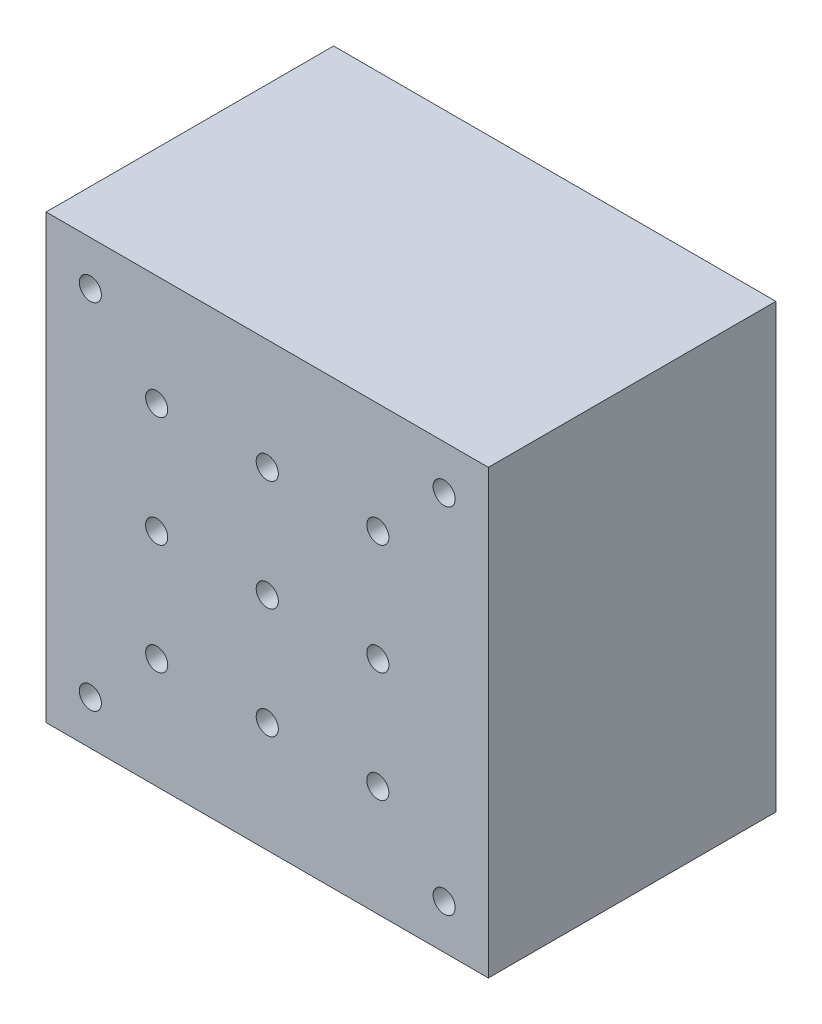
ISO-10303-21;
HEADER;
FILE_DESCRIPTION(('STEP AP214'),'2;1');
FILE_NAME('part.step','',(''),(''),'','','');
FILE_SCHEMA(('AUTOMOTIVE_DESIGN { 1 0 10303 214 1 1 1 1 }'));
ENDSEC;
DATA;
#1=APPLICATION_CONTEXT('core data for automotive mechanical design processes');
#2=APPLICATION_PROTOCOL_DEFINITION('international standard','automotive_design',2000,#1);
#3=PRODUCT_CONTEXT('',#1,'mechanical');
#4=PRODUCT('Part','Part','',(#3));
#5=PRODUCT_RELATED_PRODUCT_CATEGORY('part','',(#4));
#6=PRODUCT_DEFINITION_FORMATION('','',#4);
#7=PRODUCT_DEFINITION_CONTEXT('part definition',#1,'design');
#8=PRODUCT_DEFINITION('design','',#6,#7);
#9=PRODUCT_DEFINITION_SHAPE('','',#8);
#10=(LENGTH_UNIT() NAMED_UNIT(*) SI_UNIT(.MILLI.,.METRE.));
#11=(NAMED_UNIT(*) PLANE_ANGLE_UNIT() SI_UNIT($,.RADIAN.));
#12=(NAMED_UNIT(*) SI_UNIT($,.STERADIAN.) SOLID_ANGLE_UNIT());
#13=UNCERTAINTY_MEASURE_WITH_UNIT(LENGTH_MEASURE(1.E-05),#10,'distance_accuracy_value','');
#14=(GEOMETRIC_REPRESENTATION_CONTEXT(3) GLOBAL_UNCERTAINTY_ASSIGNED_CONTEXT((#13)) GLOBAL_UNIT_ASSIGNED_CONTEXT((#10,
#11,#12)) REPRESENTATION_CONTEXT('',''));
#15=CARTESIAN_POINT('',(0.,0.,0.));
#16=DIRECTION('',(0.,0.,1.));
#17=DIRECTION('',(1.,0.,0.));
#18=AXIS2_PLACEMENT_3D('',#15,#16,#17);
#19=CARTESIAN_POINT('',(63.5,-63.5,82.55));
#20=DIRECTION('',(-1.,0.,0.));
#21=DIRECTION('',(0.,0.,1.));
#22=AXIS2_PLACEMENT_3D('',#19,#20,#21);
#23=PLANE('',#22);
#24=DIRECTION('',(0.,1.,0.));
#25=VECTOR('',#24,1.);
#26=CARTESIAN_POINT('',(63.5,-63.5,0.));
#27=LINE('',#26,#25);
#28=CARTESIAN_POINT('',(63.5,-63.5,0.));
#29=VERTEX_POINT('',#28);
#30=CARTESIAN_POINT('',(63.5,63.5,0.));
#31=VERTEX_POINT('',#30);
#32=EDGE_CURVE('E96',#29,#31,#27,.T.);
#33=ORIENTED_EDGE('',*,*,#32,.T.);
#34=DIRECTION('',(0.,0.,-1.));
#35=VECTOR('',#34,1.);
#36=CARTESIAN_POINT('',(63.5,63.5,82.55));
#37=LINE('',#36,#35);
#38=CARTESIAN_POINT('',(63.5,63.5,82.55));
#39=VERTEX_POINT('',#38);
#40=EDGE_CURVE('E11',#39,#31,#37,.T.);
#41=ORIENTED_EDGE('',*,*,#40,.F.);
#42=DIRECTION('',(0.,1.,0.));
#43=VECTOR('',#42,1.);
#44=CARTESIAN_POINT('',(63.5,-63.5,82.55));
#45=LINE('',#44,#43);
#46=CARTESIAN_POINT('',(63.5,-63.5,82.55));
#47=VERTEX_POINT('',#46);
#48=EDGE_CURVE('E84',#47,#39,#45,.T.);
#49=ORIENTED_EDGE('',*,*,#48,.F.);
#50=DIRECTION('',(0.,0.,-1.));
#51=VECTOR('',#50,1.);
#52=CARTESIAN_POINT('',(63.5,-63.5,82.55));
#53=LINE('',#52,#51);
#54=EDGE_CURVE('E92',#47,#29,#53,.T.);
#55=ORIENTED_EDGE('',*,*,#54,.T.);
#56=EDGE_LOOP('',(#33,#41,#49,#55));
#57=FACE_BOUND('',#56,.T.);
#58=ADVANCED_FACE('F33',(#57),#23,.F.);
#59=CARTESIAN_POINT('',(-63.5,63.5,82.55));
#60=DIRECTION('',(0.,-1.,0.));
#61=DIRECTION('',(0.,0.,-1.));
#62=AXIS2_PLACEMENT_3D('',#59,#60,#61);
#63=PLANE('',#62);
#64=DIRECTION('',(-1.,0.,0.));
#65=VECTOR('',#64,1.);
#66=CARTESIAN_POINT('',(-63.5,63.5,0.));
#67=LINE('',#66,#65);
#68=CARTESIAN_POINT('',(-63.5,63.5,0.));
#69=VERTEX_POINT('',#68);
#70=EDGE_CURVE('E88',#31,#69,#67,.T.);
#71=ORIENTED_EDGE('',*,*,#70,.T.);
#72=DIRECTION('',(0.,0.,-1.));
#73=VECTOR('',#72,1.);
#74=CARTESIAN_POINT('',(-63.5,63.5,82.55));
#75=LINE('',#74,#73);
#76=CARTESIAN_POINT('',(-63.5,63.5,82.55));
#77=VERTEX_POINT('',#76);
#78=EDGE_CURVE('E41',#77,#69,#75,.T.);
#79=ORIENTED_EDGE('',*,*,#78,.F.);
#80=DIRECTION('',(-1.,0.,0.));
#81=VECTOR('',#80,1.);
#82=CARTESIAN_POINT('',(-63.5,63.5,82.55));
#83=LINE('',#82,#81);
#84=EDGE_CURVE('E79',#39,#77,#83,.T.);
#85=ORIENTED_EDGE('',*,*,#84,.F.);
#86=ORIENTED_EDGE('',*,*,#40,.T.);
#87=EDGE_LOOP('',(#71,#79,#85,#86));
#88=FACE_BOUND('',#87,.T.);
#89=ADVANCED_FACE('F87',(#88),#63,.F.);
#90=CARTESIAN_POINT('',(-63.5,-63.5,82.55));
#91=DIRECTION('',(1.,0.,0.));
#92=DIRECTION('',(0.,0.,-1.));
#93=AXIS2_PLACEMENT_3D('',#90,#91,#92);
#94=PLANE('',#93);
#95=DIRECTION('',(0.,-1.,0.));
#96=VECTOR('',#95,1.);
#97=CARTESIAN_POINT('',(-63.5,-63.5,0.));
#98=LINE('',#97,#96);
#99=CARTESIAN_POINT('',(-63.5,-63.5,0.));
#100=VERTEX_POINT('',#99);
#101=EDGE_CURVE('E66',#69,#100,#98,.T.);
#102=ORIENTED_EDGE('',*,*,#101,.T.);
#103=DIRECTION('',(0.,0.,-1.));
#104=VECTOR('',#103,1.);
#105=CARTESIAN_POINT('',(-63.5,-63.5,82.55));
#106=LINE('',#105,#104);
#107=CARTESIAN_POINT('',(-63.5,-63.5,82.55));
#108=VERTEX_POINT('',#107);
#109=EDGE_CURVE('E89',#108,#100,#106,.T.);
#110=ORIENTED_EDGE('',*,*,#109,.F.);
#111=DIRECTION('',(0.,-1.,0.));
#112=VECTOR('',#111,1.);
#113=CARTESIAN_POINT('',(-63.5,-63.5,82.55));
#114=LINE('',#113,#112);
#115=EDGE_CURVE('E82',#77,#108,#114,.T.);
#116=ORIENTED_EDGE('',*,*,#115,.F.);
#117=ORIENTED_EDGE('',*,*,#78,.T.);
#118=EDGE_LOOP('',(#102,#110,#116,#117));
#119=FACE_BOUND('',#118,.T.);
#120=ADVANCED_FACE('F90',(#119),#94,.F.);
#121=CARTESIAN_POINT('',(-63.5,-63.5,82.55));
#122=DIRECTION('',(0.,1.,0.));
#123=DIRECTION('',(0.,0.,1.));
#124=AXIS2_PLACEMENT_3D('',#121,#122,#123);
#125=PLANE('',#124);
#126=DIRECTION('',(1.,0.,0.));
#127=VECTOR('',#126,1.);
#128=CARTESIAN_POINT('',(-63.5,-63.5,0.));
#129=LINE('',#128,#127);
#130=EDGE_CURVE('E72',#100,#29,#129,.T.);
#131=ORIENTED_EDGE('',*,*,#130,.T.);
#132=ORIENTED_EDGE('',*,*,#54,.F.);
#133=DIRECTION('',(1.,0.,0.));
#134=VECTOR('',#133,1.);
#135=CARTESIAN_POINT('',(-63.5,-63.5,82.55));
#136=LINE('',#135,#134);
#137=EDGE_CURVE('E49',#108,#47,#136,.T.);
#138=ORIENTED_EDGE('',*,*,#137,.F.);
#139=ORIENTED_EDGE('',*,*,#109,.T.);
#140=EDGE_LOOP('',(#131,#132,#138,#139));
#141=FACE_BOUND('',#140,.T.);
#142=ADVANCED_FACE('F104',(#141),#125,.F.);
#143=CARTESIAN_POINT('',(0.,0.,82.55));
#144=DIRECTION('',(0.,0.,-1.));
#145=DIRECTION('',(-1.,0.,0.));
#146=AXIS2_PLACEMENT_3D('',#143,#144,#145);
#147=PLANE('',#146);
#148=CARTESIAN_POINT('',(-50.8,-50.8,82.55));
#149=DIRECTION('',(0.,0.,1.));
#150=DIRECTION('',(1.,0.,0.));
#151=AXIS2_PLACEMENT_3D('',#148,#149,#150);
#152=CIRCLE('',#151,3.175);
#153=CARTESIAN_POINT('',(-47.625,-50.8,82.55));
#154=VERTEX_POINT('',#153);
#155=EDGE_CURVE('E182',#154,#154,#152,.T.);
#156=ORIENTED_EDGE('',*,*,#155,.F.);
#157=EDGE_LOOP('',(#156));
#158=FACE_BOUND('',#157,.T.);
#159=CARTESIAN_POINT('',(50.8,-50.8,82.55));
#160=DIRECTION('',(0.,0.,1.));
#161=DIRECTION('',(1.,0.,0.));
#162=AXIS2_PLACEMENT_3D('',#159,#160,#161);
#163=CIRCLE('',#162,3.175);
#164=CARTESIAN_POINT('',(53.975,-50.8,82.55));
#165=VERTEX_POINT('',#164);
#166=EDGE_CURVE('E176',#165,#165,#163,.T.);
#167=ORIENTED_EDGE('',*,*,#166,.F.);
#168=EDGE_LOOP('',(#167));
#169=FACE_BOUND('',#168,.T.);
#170=CARTESIAN_POINT('',(50.8,50.8,82.55));
#171=DIRECTION('',(0.,0.,1.));
#172=DIRECTION('',(1.,0.,0.));
#173=AXIS2_PLACEMENT_3D('',#170,#171,#172);
#174=CIRCLE('',#173,3.175);
#175=CARTESIAN_POINT('',(53.975,50.8,82.55));
#176=VERTEX_POINT('',#175);
#177=EDGE_CURVE('E170',#176,#176,#174,.T.);
#178=ORIENTED_EDGE('',*,*,#177,.F.);
#179=EDGE_LOOP('',(#178));
#180=FACE_BOUND('',#179,.T.);
#181=CARTESIAN_POINT('',(-50.8,50.8,82.55));
#182=DIRECTION('',(0.,0.,1.));
#183=DIRECTION('',(1.,0.,0.));
#184=AXIS2_PLACEMENT_3D('',#181,#182,#183);
#185=CIRCLE('',#184,3.175);
#186=CARTESIAN_POINT('',(-47.625,50.8,82.55));
#187=VERTEX_POINT('',#186);
#188=EDGE_CURVE('E164',#187,#187,#185,.T.);
#189=ORIENTED_EDGE('',*,*,#188,.F.);
#190=EDGE_LOOP('',(#189));
#191=FACE_BOUND('',#190,.T.);
#192=CARTESIAN_POINT('',(-31.75,-31.75,82.55));
#193=DIRECTION('',(0.,0.,1.));
#194=DIRECTION('',(1.,0.,0.));
#195=AXIS2_PLACEMENT_3D('',#192,#193,#194);
#196=CIRCLE('',#195,3.175);
#197=CARTESIAN_POINT('',(-28.575,-31.75,82.55));
#198=VERTEX_POINT('',#197);
#199=EDGE_CURVE('E158',#198,#198,#196,.T.);
#200=ORIENTED_EDGE('',*,*,#199,.F.);
#201=EDGE_LOOP('',(#200));
#202=FACE_BOUND('',#201,.T.);
#203=CARTESIAN_POINT('',(31.75,-31.75,82.55));
#204=DIRECTION('',(0.,0.,1.));
#205=DIRECTION('',(1.,0.,0.));
#206=AXIS2_PLACEMENT_3D('',#203,#204,#205);
#207=CIRCLE('',#206,3.175);
#208=CARTESIAN_POINT('',(34.925,-31.75,82.55));
#209=VERTEX_POINT('',#208);
#210=EDGE_CURVE('E152',#209,#209,#207,.T.);
#211=ORIENTED_EDGE('',*,*,#210,.F.);
#212=EDGE_LOOP('',(#211));
#213=FACE_BOUND('',#212,.T.);
#214=CARTESIAN_POINT('',(0.,-31.75,82.55));
#215=DIRECTION('',(0.,0.,1.));
#216=DIRECTION('',(1.,0.,0.));
#217=AXIS2_PLACEMENT_3D('',#214,#215,#216);
#218=CIRCLE('',#217,3.175);
#219=CARTESIAN_POINT('',(3.175,-31.75,82.55));
#220=VERTEX_POINT('',#219);
#221=EDGE_CURVE('E146',#220,#220,#218,.T.);
#222=ORIENTED_EDGE('',*,*,#221,.F.);
#223=EDGE_LOOP('',(#222));
#224=FACE_BOUND('',#223,.T.);
#225=CARTESIAN_POINT('',(-31.75,31.75,82.55));
#226=DIRECTION('',(0.,0.,1.));
#227=DIRECTION('',(1.,0.,0.));
#228=AXIS2_PLACEMENT_3D('',#225,#226,#227);
#229=CIRCLE('',#228,3.175);
#230=CARTESIAN_POINT('',(-28.575,31.75,82.55));
#231=VERTEX_POINT('',#230);
#232=EDGE_CURVE('E140',#231,#231,#229,.T.);
#233=ORIENTED_EDGE('',*,*,#232,.F.);
#234=EDGE_LOOP('',(#233));
#235=FACE_BOUND('',#234,.T.);
#236=CARTESIAN_POINT('',(31.75,31.75,82.55));
#237=DIRECTION('',(0.,0.,1.));
#238=DIRECTION('',(1.,0.,0.));
#239=AXIS2_PLACEMENT_3D('',#236,#237,#238);
#240=CIRCLE('',#239,3.175);
#241=CARTESIAN_POINT('',(34.925,31.75,82.55));
#242=VERTEX_POINT('',#241);
#243=EDGE_CURVE('E134',#242,#242,#240,.T.);
#244=ORIENTED_EDGE('',*,*,#243,.F.);
#245=EDGE_LOOP('',(#244));
#246=FACE_BOUND('',#245,.T.);
#247=CARTESIAN_POINT('',(0.,31.75,82.55));
#248=DIRECTION('',(0.,0.,1.));
#249=DIRECTION('',(1.,0.,0.));
#250=AXIS2_PLACEMENT_3D('',#247,#248,#249);
#251=CIRCLE('',#250,3.175);
#252=CARTESIAN_POINT('',(3.175,31.75,82.55));
#253=VERTEX_POINT('',#252);
#254=EDGE_CURVE('E128',#253,#253,#251,.T.);
#255=ORIENTED_EDGE('',*,*,#254,.F.);
#256=EDGE_LOOP('',(#255));
#257=FACE_BOUND('',#256,.T.);
#258=CARTESIAN_POINT('',(-31.75,0.,82.55));
#259=DIRECTION('',(0.,0.,1.));
#260=DIRECTION('',(1.,0.,0.));
#261=AXIS2_PLACEMENT_3D('',#258,#259,#260);
#262=CIRCLE('',#261,3.175);
#263=CARTESIAN_POINT('',(-28.575,0.,82.55));
#264=VERTEX_POINT('',#263);
#265=EDGE_CURVE('E122',#264,#264,#262,.T.);
#266=ORIENTED_EDGE('',*,*,#265,.F.);
#267=EDGE_LOOP('',(#266));
#268=FACE_BOUND('',#267,.T.);
#269=CARTESIAN_POINT('',(31.75,0.,82.55));
#270=DIRECTION('',(0.,0.,1.));
#271=DIRECTION('',(1.,0.,0.));
#272=AXIS2_PLACEMENT_3D('',#269,#270,#271);
#273=CIRCLE('',#272,3.175);
#274=CARTESIAN_POINT('',(34.925,0.,82.55));
#275=VERTEX_POINT('',#274);
#276=EDGE_CURVE('E116',#275,#275,#273,.T.);
#277=ORIENTED_EDGE('',*,*,#276,.F.);
#278=EDGE_LOOP('',(#277));
#279=FACE_BOUND('',#278,.T.);
#280=CARTESIAN_POINT('',(0.,0.,82.55));
#281=DIRECTION('',(0.,0.,1.));
#282=DIRECTION('',(1.,0.,0.));
#283=AXIS2_PLACEMENT_3D('',#280,#281,#282);
#284=CIRCLE('',#283,3.175);
#285=CARTESIAN_POINT('',(3.175,0.,82.55));
#286=VERTEX_POINT('',#285);
#287=EDGE_CURVE('E110',#286,#286,#284,.T.);
#288=ORIENTED_EDGE('',*,*,#287,.F.);
#289=EDGE_LOOP('',(#288));
#290=FACE_BOUND('',#289,.T.);
#291=ORIENTED_EDGE('',*,*,#48,.T.);
#292=ORIENTED_EDGE('',*,*,#84,.T.);
#293=ORIENTED_EDGE('',*,*,#115,.T.);
#294=ORIENTED_EDGE('',*,*,#137,.T.);
#295=EDGE_LOOP('',(#291,#292,#293,#294));
#296=FACE_BOUND('',#295,.T.);
#297=ADVANCED_FACE('F80',(#158,#169,#180,#191,#202,#213,#224,#235,#246,#257,#268,#279,#290,
#296),#147,.F.);
#298=CARTESIAN_POINT('',(0.,0.,0.));
#299=DIRECTION('',(0.,0.,-1.));
#300=DIRECTION('',(-1.,0.,0.));
#301=AXIS2_PLACEMENT_3D('',#298,#299,#300);
#302=PLANE('',#301);
#303=CARTESIAN_POINT('',(-50.8,-50.8,0.));
#304=DIRECTION('',(0.,0.,1.));
#305=DIRECTION('',(1.,0.,0.));
#306=AXIS2_PLACEMENT_3D('',#303,#304,#305);
#307=CIRCLE('',#306,3.175);
#308=CARTESIAN_POINT('',(-47.625,-50.8,0.));
#309=VERTEX_POINT('',#308);
#310=EDGE_CURVE('E179',#309,#309,#307,.T.);
#311=ORIENTED_EDGE('',*,*,#310,.T.);
#312=EDGE_LOOP('',(#311));
#313=FACE_BOUND('',#312,.T.);
#314=CARTESIAN_POINT('',(50.8,-50.8,0.));
#315=DIRECTION('',(0.,0.,1.));
#316=DIRECTION('',(1.,0.,0.));
#317=AXIS2_PLACEMENT_3D('',#314,#315,#316);
#318=CIRCLE('',#317,3.175);
#319=CARTESIAN_POINT('',(53.975,-50.8,0.));
#320=VERTEX_POINT('',#319);
#321=EDGE_CURVE('E173',#320,#320,#318,.T.);
#322=ORIENTED_EDGE('',*,*,#321,.T.);
#323=EDGE_LOOP('',(#322));
#324=FACE_BOUND('',#323,.T.);
#325=CARTESIAN_POINT('',(50.8,50.8,0.));
#326=DIRECTION('',(0.,0.,1.));
#327=DIRECTION('',(1.,0.,0.));
#328=AXIS2_PLACEMENT_3D('',#325,#326,#327);
#329=CIRCLE('',#328,3.175);
#330=CARTESIAN_POINT('',(53.975,50.8,0.));
#331=VERTEX_POINT('',#330);
#332=EDGE_CURVE('E167',#331,#331,#329,.T.);
#333=ORIENTED_EDGE('',*,*,#332,.T.);
#334=EDGE_LOOP('',(#333));
#335=FACE_BOUND('',#334,.T.);
#336=CARTESIAN_POINT('',(-50.8,50.8,0.));
#337=DIRECTION('',(0.,0.,1.));
#338=DIRECTION('',(1.,0.,0.));
#339=AXIS2_PLACEMENT_3D('',#336,#337,#338);
#340=CIRCLE('',#339,3.175);
#341=CARTESIAN_POINT('',(-47.625,50.8,0.));
#342=VERTEX_POINT('',#341);
#343=EDGE_CURVE('E161',#342,#342,#340,.T.);
#344=ORIENTED_EDGE('',*,*,#343,.T.);
#345=EDGE_LOOP('',(#344));
#346=FACE_BOUND('',#345,.T.);
#347=CARTESIAN_POINT('',(-31.75,-31.75,0.));
#348=DIRECTION('',(0.,0.,1.));
#349=DIRECTION('',(1.,0.,0.));
#350=AXIS2_PLACEMENT_3D('',#347,#348,#349);
#351=CIRCLE('',#350,3.175);
#352=CARTESIAN_POINT('',(-28.575,-31.75,0.));
#353=VERTEX_POINT('',#352);
#354=EDGE_CURVE('E155',#353,#353,#351,.T.);
#355=ORIENTED_EDGE('',*,*,#354,.T.);
#356=EDGE_LOOP('',(#355));
#357=FACE_BOUND('',#356,.T.);
#358=CARTESIAN_POINT('',(31.75,-31.75,0.));
#359=DIRECTION('',(0.,0.,1.));
#360=DIRECTION('',(1.,0.,0.));
#361=AXIS2_PLACEMENT_3D('',#358,#359,#360);
#362=CIRCLE('',#361,3.175);
#363=CARTESIAN_POINT('',(34.925,-31.75,0.));
#364=VERTEX_POINT('',#363);
#365=EDGE_CURVE('E149',#364,#364,#362,.T.);
#366=ORIENTED_EDGE('',*,*,#365,.T.);
#367=EDGE_LOOP('',(#366));
#368=FACE_BOUND('',#367,.T.);
#369=CARTESIAN_POINT('',(0.,-31.75,0.));
#370=DIRECTION('',(0.,0.,1.));
#371=DIRECTION('',(1.,0.,0.));
#372=AXIS2_PLACEMENT_3D('',#369,#370,#371);
#373=CIRCLE('',#372,3.175);
#374=CARTESIAN_POINT('',(3.175,-31.75,0.));
#375=VERTEX_POINT('',#374);
#376=EDGE_CURVE('E143',#375,#375,#373,.T.);
#377=ORIENTED_EDGE('',*,*,#376,.T.);
#378=EDGE_LOOP('',(#377));
#379=FACE_BOUND('',#378,.T.);
#380=CARTESIAN_POINT('',(-31.75,31.75,0.));
#381=DIRECTION('',(0.,0.,1.));
#382=DIRECTION('',(1.,0.,0.));
#383=AXIS2_PLACEMENT_3D('',#380,#381,#382);
#384=CIRCLE('',#383,3.175);
#385=CARTESIAN_POINT('',(-28.575,31.75,0.));
#386=VERTEX_POINT('',#385);
#387=EDGE_CURVE('E137',#386,#386,#384,.T.);
#388=ORIENTED_EDGE('',*,*,#387,.T.);
#389=EDGE_LOOP('',(#388));
#390=FACE_BOUND('',#389,.T.);
#391=CARTESIAN_POINT('',(31.75,31.75,0.));
#392=DIRECTION('',(0.,0.,1.));
#393=DIRECTION('',(1.,0.,0.));
#394=AXIS2_PLACEMENT_3D('',#391,#392,#393);
#395=CIRCLE('',#394,3.175);
#396=CARTESIAN_POINT('',(34.925,31.75,0.));
#397=VERTEX_POINT('',#396);
#398=EDGE_CURVE('E131',#397,#397,#395,.T.);
#399=ORIENTED_EDGE('',*,*,#398,.T.);
#400=EDGE_LOOP('',(#399));
#401=FACE_BOUND('',#400,.T.);
#402=CARTESIAN_POINT('',(0.,31.75,0.));
#403=DIRECTION('',(0.,0.,1.));
#404=DIRECTION('',(1.,0.,0.));
#405=AXIS2_PLACEMENT_3D('',#402,#403,#404);
#406=CIRCLE('',#405,3.175);
#407=CARTESIAN_POINT('',(3.175,31.75,0.));
#408=VERTEX_POINT('',#407);
#409=EDGE_CURVE('E125',#408,#408,#406,.T.);
#410=ORIENTED_EDGE('',*,*,#409,.T.);
#411=EDGE_LOOP('',(#410));
#412=FACE_BOUND('',#411,.T.);
#413=CARTESIAN_POINT('',(-31.75,0.,0.));
#414=DIRECTION('',(0.,0.,1.));
#415=DIRECTION('',(1.,0.,0.));
#416=AXIS2_PLACEMENT_3D('',#413,#414,#415);
#417=CIRCLE('',#416,3.175);
#418=CARTESIAN_POINT('',(-28.575,0.,0.));
#419=VERTEX_POINT('',#418);
#420=EDGE_CURVE('E119',#419,#419,#417,.T.);
#421=ORIENTED_EDGE('',*,*,#420,.T.);
#422=EDGE_LOOP('',(#421));
#423=FACE_BOUND('',#422,.T.);
#424=CARTESIAN_POINT('',(31.75,0.,0.));
#425=DIRECTION('',(0.,0.,1.));
#426=DIRECTION('',(1.,0.,0.));
#427=AXIS2_PLACEMENT_3D('',#424,#425,#426);
#428=CIRCLE('',#427,3.175);
#429=CARTESIAN_POINT('',(34.925,0.,0.));
#430=VERTEX_POINT('',#429);
#431=EDGE_CURVE('E113',#430,#430,#428,.T.);
#432=ORIENTED_EDGE('',*,*,#431,.T.);
#433=EDGE_LOOP('',(#432));
#434=FACE_BOUND('',#433,.T.);
#435=CARTESIAN_POINT('',(0.,0.,0.));
#436=DIRECTION('',(0.,0.,1.));
#437=DIRECTION('',(1.,0.,0.));
#438=AXIS2_PLACEMENT_3D('',#435,#436,#437);
#439=CIRCLE('',#438,3.175);
#440=CARTESIAN_POINT('',(3.175,0.,0.));
#441=VERTEX_POINT('',#440);
#442=EDGE_CURVE('E99',#441,#441,#439,.T.);
#443=ORIENTED_EDGE('',*,*,#442,.T.);
#444=EDGE_LOOP('',(#443));
#445=FACE_BOUND('',#444,.T.);
#446=ORIENTED_EDGE('',*,*,#32,.F.);
#447=ORIENTED_EDGE('',*,*,#130,.F.);
#448=ORIENTED_EDGE('',*,*,#101,.F.);
#449=ORIENTED_EDGE('',*,*,#70,.F.);
#450=EDGE_LOOP('',(#446,#447,#448,#449));
#451=FACE_BOUND('',#450,.T.);
#452=ADVANCED_FACE('F107',(#313,#324,#335,#346,#357,#368,#379,#390,#401,#412,#423,#434,#445,
#451),#302,.T.);
#453=CARTESIAN_POINT('',(0.,0.,0.));
#454=DIRECTION('',(0.,0.,1.));
#455=DIRECTION('',(1.,0.,0.));
#456=AXIS2_PLACEMENT_3D('',#453,#454,#455);
#457=CYLINDRICAL_SURFACE('',#456,3.175);
#458=ORIENTED_EDGE('',*,*,#442,.F.);
#459=EDGE_LOOP('',(#458));
#460=FACE_BOUND('',#459,.T.);
#461=ORIENTED_EDGE('',*,*,#287,.T.);
#462=EDGE_LOOP('',(#461));
#463=FACE_BOUND('',#462,.T.);
#464=ADVANCED_FACE('F224',(#460,#463),#457,.F.);
#465=CARTESIAN_POINT('',(31.75,0.,0.));
#466=DIRECTION('',(0.,0.,1.));
#467=DIRECTION('',(1.,0.,0.));
#468=AXIS2_PLACEMENT_3D('',#465,#466,#467);
#469=CYLINDRICAL_SURFACE('',#468,3.175);
#470=ORIENTED_EDGE('',*,*,#431,.F.);
#471=EDGE_LOOP('',(#470));
#472=FACE_BOUND('',#471,.T.);
#473=ORIENTED_EDGE('',*,*,#276,.T.);
#474=EDGE_LOOP('',(#473));
#475=FACE_BOUND('',#474,.T.);
#476=ADVANCED_FACE('F226',(#472,#475),#469,.F.);
#477=CARTESIAN_POINT('',(-31.75,0.,0.));
#478=DIRECTION('',(0.,0.,1.));
#479=DIRECTION('',(1.,0.,0.));
#480=AXIS2_PLACEMENT_3D('',#477,#478,#479);
#481=CYLINDRICAL_SURFACE('',#480,3.175);
#482=ORIENTED_EDGE('',*,*,#420,.F.);
#483=EDGE_LOOP('',(#482));
#484=FACE_BOUND('',#483,.T.);
#485=ORIENTED_EDGE('',*,*,#265,.T.);
#486=EDGE_LOOP('',(#485));
#487=FACE_BOUND('',#486,.T.);
#488=ADVANCED_FACE('F233',(#484,#487),#481,.F.);
#489=CARTESIAN_POINT('',(0.,31.75,0.));
#490=DIRECTION('',(0.,0.,1.));
#491=DIRECTION('',(1.,0.,0.));
#492=AXIS2_PLACEMENT_3D('',#489,#490,#491);
#493=CYLINDRICAL_SURFACE('',#492,3.175);
#494=ORIENTED_EDGE('',*,*,#409,.F.);
#495=EDGE_LOOP('',(#494));
#496=FACE_BOUND('',#495,.T.);
#497=ORIENTED_EDGE('',*,*,#254,.T.);
#498=EDGE_LOOP('',(#497));
#499=FACE_BOUND('',#498,.T.);
#500=ADVANCED_FACE('F324',(#496,#499),#493,.F.);
#501=CARTESIAN_POINT('',(31.75,31.75,0.));
#502=DIRECTION('',(0.,0.,1.));
#503=DIRECTION('',(1.,0.,0.));
#504=AXIS2_PLACEMENT_3D('',#501,#502,#503);
#505=CYLINDRICAL_SURFACE('',#504,3.175);
#506=ORIENTED_EDGE('',*,*,#398,.F.);
#507=EDGE_LOOP('',(#506));
#508=FACE_BOUND('',#507,.T.);
#509=ORIENTED_EDGE('',*,*,#243,.T.);
#510=EDGE_LOOP('',(#509));
#511=FACE_BOUND('',#510,.T.);
#512=ADVANCED_FACE('F320',(#508,#511),#505,.F.);
#513=CARTESIAN_POINT('',(-31.75,31.75,0.));
#514=DIRECTION('',(0.,0.,1.));
#515=DIRECTION('',(1.,0.,0.));
#516=AXIS2_PLACEMENT_3D('',#513,#514,#515);
#517=CYLINDRICAL_SURFACE('',#516,3.175);
#518=ORIENTED_EDGE('',*,*,#387,.F.);
#519=EDGE_LOOP('',(#518));
#520=FACE_BOUND('',#519,.T.);
#521=ORIENTED_EDGE('',*,*,#232,.T.);
#522=EDGE_LOOP('',(#521));
#523=FACE_BOUND('',#522,.T.);
#524=ADVANCED_FACE('F316',(#520,#523),#517,.F.);
#525=CARTESIAN_POINT('',(0.,-31.75,0.));
#526=DIRECTION('',(0.,0.,1.));
#527=DIRECTION('',(1.,0.,0.));
#528=AXIS2_PLACEMENT_3D('',#525,#526,#527);
#529=CYLINDRICAL_SURFACE('',#528,3.175);
#530=ORIENTED_EDGE('',*,*,#376,.F.);
#531=EDGE_LOOP('',(#530));
#532=FACE_BOUND('',#531,.T.);
#533=ORIENTED_EDGE('',*,*,#221,.T.);
#534=EDGE_LOOP('',(#533));
#535=FACE_BOUND('',#534,.T.);
#536=ADVANCED_FACE('F312',(#532,#535),#529,.F.);
#537=CARTESIAN_POINT('',(31.75,-31.75,0.));
#538=DIRECTION('',(0.,0.,1.));
#539=DIRECTION('',(1.,0.,0.));
#540=AXIS2_PLACEMENT_3D('',#537,#538,#539);
#541=CYLINDRICAL_SURFACE('',#540,3.175);
#542=ORIENTED_EDGE('',*,*,#365,.F.);
#543=EDGE_LOOP('',(#542));
#544=FACE_BOUND('',#543,.T.);
#545=ORIENTED_EDGE('',*,*,#210,.T.);
#546=EDGE_LOOP('',(#545));
#547=FACE_BOUND('',#546,.T.);
#548=ADVANCED_FACE('F308',(#544,#547),#541,.F.);
#549=CARTESIAN_POINT('',(-31.75,-31.75,0.));
#550=DIRECTION('',(0.,0.,1.));
#551=DIRECTION('',(1.,0.,0.));
#552=AXIS2_PLACEMENT_3D('',#549,#550,#551);
#553=CYLINDRICAL_SURFACE('',#552,3.175);
#554=ORIENTED_EDGE('',*,*,#354,.F.);
#555=EDGE_LOOP('',(#554));
#556=FACE_BOUND('',#555,.T.);
#557=ORIENTED_EDGE('',*,*,#199,.T.);
#558=EDGE_LOOP('',(#557));
#559=FACE_BOUND('',#558,.T.);
#560=ADVANCED_FACE('F273',(#556,#559),#553,.F.);
#561=CARTESIAN_POINT('',(-50.8,50.8,0.));
#562=DIRECTION('',(0.,0.,1.));
#563=DIRECTION('',(1.,0.,0.));
#564=AXIS2_PLACEMENT_3D('',#561,#562,#563);
#565=CYLINDRICAL_SURFACE('',#564,3.175);
#566=ORIENTED_EDGE('',*,*,#343,.F.);
#567=EDGE_LOOP('',(#566));
#568=FACE_BOUND('',#567,.T.);
#569=ORIENTED_EDGE('',*,*,#188,.T.);
#570=EDGE_LOOP('',(#569));
#571=FACE_BOUND('',#570,.T.);
#572=ADVANCED_FACE('F267',(#568,#571),#565,.F.);
#573=CARTESIAN_POINT('',(50.8,50.8,0.));
#574=DIRECTION('',(0.,0.,1.));
#575=DIRECTION('',(1.,0.,0.));
#576=AXIS2_PLACEMENT_3D('',#573,#574,#575);
#577=CYLINDRICAL_SURFACE('',#576,3.175);
#578=ORIENTED_EDGE('',*,*,#332,.F.);
#579=EDGE_LOOP('',(#578));
#580=FACE_BOUND('',#579,.T.);
#581=ORIENTED_EDGE('',*,*,#177,.T.);
#582=EDGE_LOOP('',(#581));
#583=FACE_BOUND('',#582,.T.);
#584=ADVANCED_FACE('F272',(#580,#583),#577,.F.);
#585=CARTESIAN_POINT('',(50.8,-50.8,0.));
#586=DIRECTION('',(0.,0.,1.));
#587=DIRECTION('',(1.,0.,0.));
#588=AXIS2_PLACEMENT_3D('',#585,#586,#587);
#589=CYLINDRICAL_SURFACE('',#588,3.175);
#590=ORIENTED_EDGE('',*,*,#321,.F.);
#591=EDGE_LOOP('',(#590));
#592=FACE_BOUND('',#591,.T.);
#593=ORIENTED_EDGE('',*,*,#166,.T.);
#594=EDGE_LOOP('',(#593));
#595=FACE_BOUND('',#594,.T.);
#596=ADVANCED_FACE('F193',(#592,#595),#589,.F.);
#597=CARTESIAN_POINT('',(-50.8,-50.8,0.));
#598=DIRECTION('',(0.,0.,1.));
#599=DIRECTION('',(1.,0.,0.));
#600=AXIS2_PLACEMENT_3D('',#597,#598,#599);
#601=CYLINDRICAL_SURFACE('',#600,3.175);
#602=ORIENTED_EDGE('',*,*,#310,.F.);
#603=EDGE_LOOP('',(#602));
#604=FACE_BOUND('',#603,.T.);
#605=ORIENTED_EDGE('',*,*,#155,.T.);
#606=EDGE_LOOP('',(#605));
#607=FACE_BOUND('',#606,.T.);
#608=ADVANCED_FACE('F190',(#604,#607),#601,.F.);
#609=CLOSED_SHELL('',(#58,#89,#120,#142,#297,#452,#464,#476,#488,#500,#512,#524,#536,#548,#560,
#572,#584,#596,#608));
#610=MANIFOLD_SOLID_BREP('B2',#609);
#611=ADVANCED_BREP_SHAPE_REPRESENTATION('',(#18,#610),#14);
#612=SHAPE_DEFINITION_REPRESENTATION(#9,#611);
ENDSEC;
END-ISO-10303-21;
